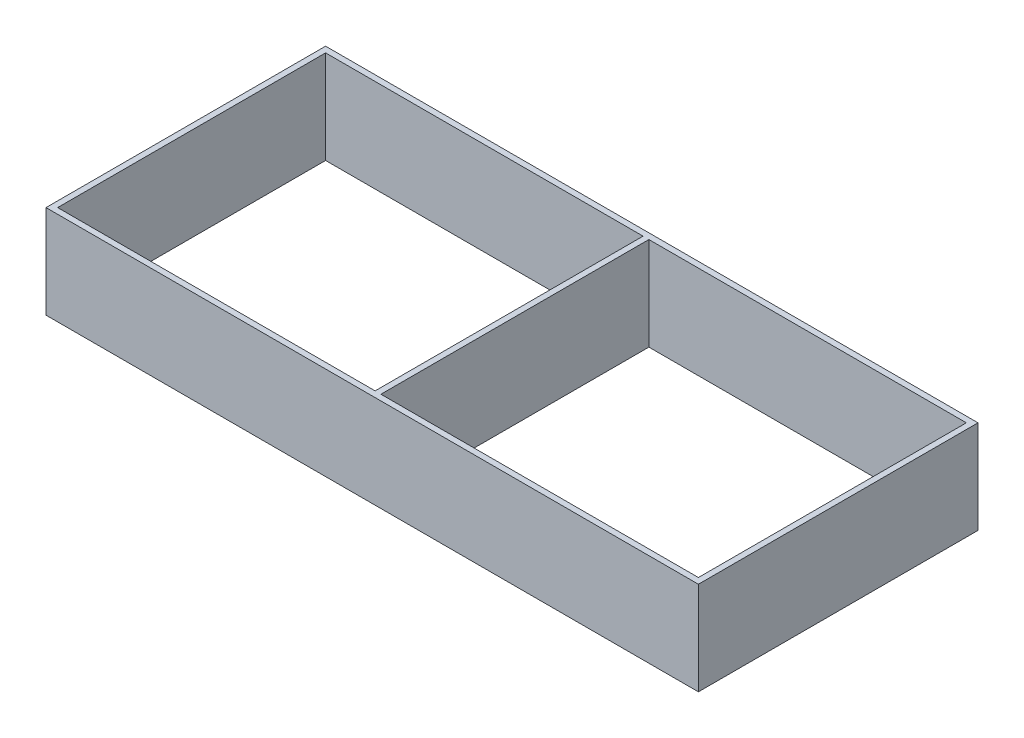
ISO-10303-21;
HEADER;
FILE_DESCRIPTION(('STEP AP214'),'2;1');
FILE_NAME('part.step','',(''),(''),'','','');
FILE_SCHEMA(('AUTOMOTIVE_DESIGN { 1 0 10303 214 1 1 1 1 }'));
ENDSEC;
DATA;
#1=APPLICATION_CONTEXT('core data for automotive mechanical design processes');
#2=APPLICATION_PROTOCOL_DEFINITION('international standard','automotive_design',2000,#1);
#3=PRODUCT_CONTEXT('',#1,'mechanical');
#4=PRODUCT('Part','Part','',(#3));
#5=PRODUCT_RELATED_PRODUCT_CATEGORY('part','',(#4));
#6=PRODUCT_DEFINITION_FORMATION('','',#4);
#7=PRODUCT_DEFINITION_CONTEXT('part definition',#1,'design');
#8=PRODUCT_DEFINITION('design','',#6,#7);
#9=PRODUCT_DEFINITION_SHAPE('','',#8);
#10=(LENGTH_UNIT() NAMED_UNIT(*) SI_UNIT(.MILLI.,.METRE.));
#11=(NAMED_UNIT(*) PLANE_ANGLE_UNIT() SI_UNIT($,.RADIAN.));
#12=(NAMED_UNIT(*) SI_UNIT($,.STERADIAN.) SOLID_ANGLE_UNIT());
#13=UNCERTAINTY_MEASURE_WITH_UNIT(LENGTH_MEASURE(1.E-05),#10,'distance_accuracy_value','');
#14=(GEOMETRIC_REPRESENTATION_CONTEXT(3) GLOBAL_UNCERTAINTY_ASSIGNED_CONTEXT((#13)) GLOBAL_UNIT_ASSIGNED_CONTEXT((#10,
#11,#12)) REPRESENTATION_CONTEXT('',''));
#15=CARTESIAN_POINT('',(0.,0.,0.));
#16=DIRECTION('',(0.,0.,1.));
#17=DIRECTION('',(1.,0.,0.));
#18=AXIS2_PLACEMENT_3D('',#15,#16,#17);
#19=CARTESIAN_POINT('',(0.,50.8,0.));
#20=DIRECTION('',(0.,1.,0.));
#21=DIRECTION('',(0.,0.,1.));
#22=AXIS2_PLACEMENT_3D('',#19,#20,#21);
#23=PLANE('',#22);
#24=DIRECTION('',(0.,0.,-1.));
#25=VECTOR('',#24,1.);
#26=CARTESIAN_POINT('',(0.,50.8,0.));
#27=LINE('',#26,#25);
#28=CARTESIAN_POINT('',(0.,50.8,0.));
#29=VERTEX_POINT('',#28);
#30=CARTESIAN_POINT('',(0.,50.8,-152.4));
#31=VERTEX_POINT('',#30);
#32=EDGE_CURVE('E189',#29,#31,#27,.T.);
#33=ORIENTED_EDGE('',*,*,#32,.T.);
#34=DIRECTION('',(-1.,0.,0.));
#35=VECTOR('',#34,1.);
#36=CARTESIAN_POINT('',(0.,50.8,-152.4));
#37=LINE('',#36,#35);
#38=CARTESIAN_POINT('',(-355.6,50.8,-152.4));
#39=VERTEX_POINT('',#38);
#40=EDGE_CURVE('E192',#31,#39,#37,.T.);
#41=ORIENTED_EDGE('',*,*,#40,.T.);
#42=DIRECTION('',(0.,0.,1.));
#43=VECTOR('',#42,1.);
#44=CARTESIAN_POINT('',(-355.6,50.8,0.));
#45=LINE('',#44,#43);
#46=CARTESIAN_POINT('',(-355.6,50.8,0.));
#47=VERTEX_POINT('',#46);
#48=EDGE_CURVE('E195',#39,#47,#45,.T.);
#49=ORIENTED_EDGE('',*,*,#48,.T.);
#50=DIRECTION('',(1.,0.,0.));
#51=VECTOR('',#50,1.);
#52=CARTESIAN_POINT('',(0.,50.8,0.));
#53=LINE('',#52,#51);
#54=EDGE_CURVE('E197',#47,#29,#53,.T.);
#55=ORIENTED_EDGE('',*,*,#54,.T.);
#56=EDGE_LOOP('',(#33,#41,#49,#55));
#57=FACE_BOUND('',#56,.T.);
#58=DIRECTION('',(1.,0.,0.));
#59=VECTOR('',#58,1.);
#60=CARTESIAN_POINT('',(-352.425,50.8,-3.17499999999996));
#61=LINE('',#60,#59);
#62=CARTESIAN_POINT('',(-352.425,50.8,-3.17499999999996));
#63=VERTEX_POINT('',#62);
#64=CARTESIAN_POINT('',(-179.3875,50.8,-3.17499999999996));
#65=VERTEX_POINT('',#64);
#66=EDGE_CURVE('E160',#63,#65,#61,.T.);
#67=ORIENTED_EDGE('',*,*,#66,.F.);
#68=DIRECTION('',(0.,0.,1.));
#69=VECTOR('',#68,1.);
#70=CARTESIAN_POINT('',(-352.425,50.8,-149.225));
#71=LINE('',#70,#69);
#72=CARTESIAN_POINT('',(-352.425,50.8,-149.225));
#73=VERTEX_POINT('',#72);
#74=EDGE_CURVE('E158',#73,#63,#71,.T.);
#75=ORIENTED_EDGE('',*,*,#74,.F.);
#76=DIRECTION('',(-1.,0.,0.));
#77=VECTOR('',#76,1.);
#78=CARTESIAN_POINT('',(-352.425,50.8,-149.225));
#79=LINE('',#78,#77);
#80=CARTESIAN_POINT('',(-179.3875,50.8,-149.225));
#81=VERTEX_POINT('',#80);
#82=EDGE_CURVE('E166',#81,#73,#79,.T.);
#83=ORIENTED_EDGE('',*,*,#82,.F.);
#84=DIRECTION('',(0.,0.,-1.));
#85=VECTOR('',#84,1.);
#86=CARTESIAN_POINT('',(-179.3875,50.8,-149.225));
#87=LINE('',#86,#85);
#88=EDGE_CURVE('E163',#65,#81,#87,.T.);
#89=ORIENTED_EDGE('',*,*,#88,.F.);
#90=EDGE_LOOP('',(#67,#75,#83,#89));
#91=FACE_BOUND('',#90,.T.);
#92=DIRECTION('',(0.,0.,-1.));
#93=VECTOR('',#92,1.);
#94=CARTESIAN_POINT('',(-3.17499999999998,50.8,-149.225));
#95=LINE('',#94,#93);
#96=CARTESIAN_POINT('',(-3.17499999999998,50.8,-3.17499999999996));
#97=VERTEX_POINT('',#96);
#98=CARTESIAN_POINT('',(-3.17499999999998,50.8,-149.225));
#99=VERTEX_POINT('',#98);
#100=EDGE_CURVE('E130',#97,#99,#95,.T.);
#101=ORIENTED_EDGE('',*,*,#100,.F.);
#102=DIRECTION('',(1.,0.,0.));
#103=VECTOR('',#102,1.);
#104=CARTESIAN_POINT('',(-176.2125,50.8,-3.17499999999996));
#105=LINE('',#104,#103);
#106=CARTESIAN_POINT('',(-176.2125,50.8,-3.17499999999996));
#107=VERTEX_POINT('',#106);
#108=EDGE_CURVE('E122',#107,#97,#105,.T.);
#109=ORIENTED_EDGE('',*,*,#108,.F.);
#110=DIRECTION('',(0.,0.,1.));
#111=VECTOR('',#110,1.);
#112=CARTESIAN_POINT('',(-176.2125,50.8,-149.225));
#113=LINE('',#112,#111);
#114=CARTESIAN_POINT('',(-176.2125,50.8,-149.225));
#115=VERTEX_POINT('',#114);
#116=EDGE_CURVE('E144',#115,#107,#113,.T.);
#117=ORIENTED_EDGE('',*,*,#116,.F.);
#118=DIRECTION('',(-1.,0.,0.));
#119=VECTOR('',#118,1.);
#120=CARTESIAN_POINT('',(-176.2125,50.8,-149.225));
#121=LINE('',#120,#119);
#122=EDGE_CURVE('E142',#99,#115,#121,.T.);
#123=ORIENTED_EDGE('',*,*,#122,.F.);
#124=EDGE_LOOP('',(#101,#109,#117,#123));
#125=FACE_BOUND('',#124,.T.);
#126=ADVANCED_FACE('F33',(#57,#91,#125),#23,.T.);
#127=CARTESIAN_POINT('',(0.,0.,0.));
#128=DIRECTION('',(0.,1.,0.));
#129=DIRECTION('',(0.,0.,1.));
#130=AXIS2_PLACEMENT_3D('',#127,#128,#129);
#131=PLANE('',#130);
#132=DIRECTION('',(0.,0.,1.));
#133=VECTOR('',#132,1.);
#134=CARTESIAN_POINT('',(-352.425,0.,-149.225));
#135=LINE('',#134,#133);
#136=CARTESIAN_POINT('',(-352.425,0.,-149.225));
#137=VERTEX_POINT('',#136);
#138=CARTESIAN_POINT('',(-352.425,0.,-3.17499999999996));
#139=VERTEX_POINT('',#138);
#140=EDGE_CURVE('E138',#137,#139,#135,.T.);
#141=ORIENTED_EDGE('',*,*,#140,.T.);
#142=DIRECTION('',(1.,0.,0.));
#143=VECTOR('',#142,1.);
#144=CARTESIAN_POINT('',(-352.425,0.,-3.17499999999996));
#145=LINE('',#144,#143);
#146=CARTESIAN_POINT('',(-179.3875,0.,-3.17499999999996));
#147=VERTEX_POINT('',#146);
#148=EDGE_CURVE('E171',#139,#147,#145,.T.);
#149=ORIENTED_EDGE('',*,*,#148,.T.);
#150=DIRECTION('',(0.,0.,-1.));
#151=VECTOR('',#150,1.);
#152=CARTESIAN_POINT('',(-179.3875,0.,-149.225));
#153=LINE('',#152,#151);
#154=CARTESIAN_POINT('',(-179.3875,0.,-149.225));
#155=VERTEX_POINT('',#154);
#156=EDGE_CURVE('E174',#147,#155,#153,.T.);
#157=ORIENTED_EDGE('',*,*,#156,.T.);
#158=DIRECTION('',(-1.,0.,0.));
#159=VECTOR('',#158,1.);
#160=CARTESIAN_POINT('',(-352.425,0.,-149.225));
#161=LINE('',#160,#159);
#162=EDGE_CURVE('E161',#155,#137,#161,.T.);
#163=ORIENTED_EDGE('',*,*,#162,.T.);
#164=EDGE_LOOP('',(#141,#149,#157,#163));
#165=FACE_BOUND('',#164,.T.);
#166=DIRECTION('',(0.,0.,-1.));
#167=VECTOR('',#166,1.);
#168=CARTESIAN_POINT('',(0.,0.,0.));
#169=LINE('',#168,#167);
#170=CARTESIAN_POINT('',(0.,0.,0.));
#171=VERTEX_POINT('',#170);
#172=CARTESIAN_POINT('',(0.,0.,-152.4));
#173=VERTEX_POINT('',#172);
#174=EDGE_CURVE('E188',#171,#173,#169,.T.);
#175=ORIENTED_EDGE('',*,*,#174,.F.);
#176=DIRECTION('',(1.,0.,0.));
#177=VECTOR('',#176,1.);
#178=CARTESIAN_POINT('',(0.,0.,0.));
#179=LINE('',#178,#177);
#180=CARTESIAN_POINT('',(-355.6,0.,0.));
#181=VERTEX_POINT('',#180);
#182=EDGE_CURVE('E193',#181,#171,#179,.T.);
#183=ORIENTED_EDGE('',*,*,#182,.F.);
#184=DIRECTION('',(0.,0.,1.));
#185=VECTOR('',#184,1.);
#186=CARTESIAN_POINT('',(-355.6,0.,0.));
#187=LINE('',#186,#185);
#188=CARTESIAN_POINT('',(-355.6,0.,-152.4));
#189=VERTEX_POINT('',#188);
#190=EDGE_CURVE('E204',#189,#181,#187,.T.);
#191=ORIENTED_EDGE('',*,*,#190,.F.);
#192=DIRECTION('',(-1.,0.,0.));
#193=VECTOR('',#192,1.);
#194=CARTESIAN_POINT('',(0.,0.,-152.4));
#195=LINE('',#194,#193);
#196=EDGE_CURVE('E202',#173,#189,#195,.T.);
#197=ORIENTED_EDGE('',*,*,#196,.F.);
#198=EDGE_LOOP('',(#175,#183,#191,#197));
#199=FACE_BOUND('',#198,.T.);
#200=DIRECTION('',(1.,0.,0.));
#201=VECTOR('',#200,1.);
#202=CARTESIAN_POINT('',(-176.2125,0.,-3.17499999999996));
#203=LINE('',#202,#201);
#204=CARTESIAN_POINT('',(-176.2125,0.,-3.17499999999996));
#205=VERTEX_POINT('',#204);
#206=CARTESIAN_POINT('',(-3.17499999999998,0.,-3.17499999999996));
#207=VERTEX_POINT('',#206);
#208=EDGE_CURVE('E56',#205,#207,#203,.T.);
#209=ORIENTED_EDGE('',*,*,#208,.T.);
#210=DIRECTION('',(0.,0.,-1.));
#211=VECTOR('',#210,1.);
#212=CARTESIAN_POINT('',(-3.17499999999998,0.,-149.225));
#213=LINE('',#212,#211);
#214=CARTESIAN_POINT('',(-3.17499999999998,0.,-149.225));
#215=VERTEX_POINT('',#214);
#216=EDGE_CURVE('E137',#207,#215,#213,.T.);
#217=ORIENTED_EDGE('',*,*,#216,.T.);
#218=DIRECTION('',(-1.,0.,0.));
#219=VECTOR('',#218,1.);
#220=CARTESIAN_POINT('',(-176.2125,0.,-149.225));
#221=LINE('',#220,#219);
#222=CARTESIAN_POINT('',(-176.2125,0.,-149.225));
#223=VERTEX_POINT('',#222);
#224=EDGE_CURVE('E150',#215,#223,#221,.T.);
#225=ORIENTED_EDGE('',*,*,#224,.T.);
#226=DIRECTION('',(0.,0.,1.));
#227=VECTOR('',#226,1.);
#228=CARTESIAN_POINT('',(-176.2125,0.,-149.225));
#229=LINE('',#228,#227);
#230=EDGE_CURVE('E131',#223,#205,#229,.T.);
#231=ORIENTED_EDGE('',*,*,#230,.T.);
#232=EDGE_LOOP('',(#209,#217,#225,#231));
#233=FACE_BOUND('',#232,.T.);
#234=ADVANCED_FACE('F222',(#165,#199,#233),#131,.F.);
#235=CARTESIAN_POINT('',(0.,50.8,0.));
#236=DIRECTION('',(-1.,0.,0.));
#237=DIRECTION('',(0.,0.,1.));
#238=AXIS2_PLACEMENT_3D('',#235,#236,#237);
#239=PLANE('',#238);
#240=ORIENTED_EDGE('',*,*,#174,.T.);
#241=DIRECTION('',(0.,-1.,0.));
#242=VECTOR('',#241,1.);
#243=CARTESIAN_POINT('',(0.,50.8,-152.4));
#244=LINE('',#243,#242);
#245=EDGE_CURVE('E11',#31,#173,#244,.T.);
#246=ORIENTED_EDGE('',*,*,#245,.F.);
#247=ORIENTED_EDGE('',*,*,#32,.F.);
#248=DIRECTION('',(0.,-1.,0.));
#249=VECTOR('',#248,1.);
#250=CARTESIAN_POINT('',(0.,50.8,0.));
#251=LINE('',#250,#249);
#252=EDGE_CURVE('E199',#29,#171,#251,.T.);
#253=ORIENTED_EDGE('',*,*,#252,.T.);
#254=EDGE_LOOP('',(#240,#246,#247,#253));
#255=FACE_BOUND('',#254,.T.);
#256=ADVANCED_FACE('F35',(#255),#239,.F.);
#257=CARTESIAN_POINT('',(0.,50.8,-152.4));
#258=DIRECTION('',(0.,0.,1.));
#259=DIRECTION('',(1.,0.,0.));
#260=AXIS2_PLACEMENT_3D('',#257,#258,#259);
#261=PLANE('',#260);
#262=ORIENTED_EDGE('',*,*,#196,.T.);
#263=DIRECTION('',(0.,-1.,0.));
#264=VECTOR('',#263,1.);
#265=CARTESIAN_POINT('',(-355.6,50.8,-152.4));
#266=LINE('',#265,#264);
#267=EDGE_CURVE('E41',#39,#189,#266,.T.);
#268=ORIENTED_EDGE('',*,*,#267,.F.);
#269=ORIENTED_EDGE('',*,*,#40,.F.);
#270=ORIENTED_EDGE('',*,*,#245,.T.);
#271=EDGE_LOOP('',(#262,#268,#269,#270));
#272=FACE_BOUND('',#271,.T.);
#273=ADVANCED_FACE('F233',(#272),#261,.F.);
#274=CARTESIAN_POINT('',(-355.6,50.8,0.));
#275=DIRECTION('',(1.,0.,0.));
#276=DIRECTION('',(0.,0.,-1.));
#277=AXIS2_PLACEMENT_3D('',#274,#275,#276);
#278=PLANE('',#277);
#279=ORIENTED_EDGE('',*,*,#190,.T.);
#280=DIRECTION('',(0.,-1.,0.));
#281=VECTOR('',#280,1.);
#282=CARTESIAN_POINT('',(-355.6,50.8,0.));
#283=LINE('',#282,#281);
#284=EDGE_CURVE('E209',#47,#181,#283,.T.);
#285=ORIENTED_EDGE('',*,*,#284,.F.);
#286=ORIENTED_EDGE('',*,*,#48,.F.);
#287=ORIENTED_EDGE('',*,*,#267,.T.);
#288=EDGE_LOOP('',(#279,#285,#286,#287));
#289=FACE_BOUND('',#288,.T.);
#290=ADVANCED_FACE('F216',(#289),#278,.F.);
#291=CARTESIAN_POINT('',(0.,50.8,0.));
#292=DIRECTION('',(0.,0.,-1.));
#293=DIRECTION('',(-1.,0.,0.));
#294=AXIS2_PLACEMENT_3D('',#291,#292,#293);
#295=PLANE('',#294);
#296=ORIENTED_EDGE('',*,*,#182,.T.);
#297=ORIENTED_EDGE('',*,*,#252,.F.);
#298=ORIENTED_EDGE('',*,*,#54,.F.);
#299=ORIENTED_EDGE('',*,*,#284,.T.);
#300=EDGE_LOOP('',(#296,#297,#298,#299));
#301=FACE_BOUND('',#300,.T.);
#302=ADVANCED_FACE('F226',(#301),#295,.F.);
#303=CARTESIAN_POINT('',(-352.425,50.8,-149.225));
#304=DIRECTION('',(1.,0.,0.));
#305=DIRECTION('',(0.,0.,-1.));
#306=AXIS2_PLACEMENT_3D('',#303,#304,#305);
#307=PLANE('',#306);
#308=ORIENTED_EDGE('',*,*,#140,.F.);
#309=DIRECTION('',(0.,-1.,0.));
#310=VECTOR('',#309,1.);
#311=CARTESIAN_POINT('',(-352.425,50.8,-149.225));
#312=LINE('',#311,#310);
#313=EDGE_CURVE('E168',#73,#137,#312,.T.);
#314=ORIENTED_EDGE('',*,*,#313,.F.);
#315=ORIENTED_EDGE('',*,*,#74,.T.);
#316=DIRECTION('',(0.,-1.,0.));
#317=VECTOR('',#316,1.);
#318=CARTESIAN_POINT('',(-352.425,50.8,-3.17499999999996));
#319=LINE('',#318,#317);
#320=EDGE_CURVE('E185',#63,#139,#319,.T.);
#321=ORIENTED_EDGE('',*,*,#320,.T.);
#322=EDGE_LOOP('',(#308,#314,#315,#321));
#323=FACE_BOUND('',#322,.T.);
#324=ADVANCED_FACE('F248',(#323),#307,.T.);
#325=CARTESIAN_POINT('',(-352.425,50.8,-3.17499999999996));
#326=DIRECTION('',(0.,0.,-1.));
#327=DIRECTION('',(-1.,0.,0.));
#328=AXIS2_PLACEMENT_3D('',#325,#326,#327);
#329=PLANE('',#328);
#330=ORIENTED_EDGE('',*,*,#148,.F.);
#331=ORIENTED_EDGE('',*,*,#320,.F.);
#332=ORIENTED_EDGE('',*,*,#66,.T.);
#333=DIRECTION('',(0.,-1.,0.));
#334=VECTOR('',#333,1.);
#335=CARTESIAN_POINT('',(-179.3875,50.8,-3.17499999999996));
#336=LINE('',#335,#334);
#337=EDGE_CURVE('E183',#65,#147,#336,.T.);
#338=ORIENTED_EDGE('',*,*,#337,.T.);
#339=EDGE_LOOP('',(#330,#331,#332,#338));
#340=FACE_BOUND('',#339,.T.);
#341=ADVANCED_FACE('F255',(#340),#329,.T.);
#342=CARTESIAN_POINT('',(-179.3875,50.8,-149.225));
#343=DIRECTION('',(-1.,0.,0.));
#344=DIRECTION('',(0.,0.,1.));
#345=AXIS2_PLACEMENT_3D('',#342,#343,#344);
#346=PLANE('',#345);
#347=ORIENTED_EDGE('',*,*,#156,.F.);
#348=ORIENTED_EDGE('',*,*,#337,.F.);
#349=ORIENTED_EDGE('',*,*,#88,.T.);
#350=DIRECTION('',(0.,-1.,0.));
#351=VECTOR('',#350,1.);
#352=CARTESIAN_POINT('',(-179.3875,50.8,-149.225));
#353=LINE('',#352,#351);
#354=EDGE_CURVE('E181',#81,#155,#353,.T.);
#355=ORIENTED_EDGE('',*,*,#354,.T.);
#356=EDGE_LOOP('',(#347,#348,#349,#355));
#357=FACE_BOUND('',#356,.T.);
#358=ADVANCED_FACE('F260',(#357),#346,.T.);
#359=CARTESIAN_POINT('',(-352.425,50.8,-149.225));
#360=DIRECTION('',(0.,0.,1.));
#361=DIRECTION('',(1.,0.,0.));
#362=AXIS2_PLACEMENT_3D('',#359,#360,#361);
#363=PLANE('',#362);
#364=ORIENTED_EDGE('',*,*,#162,.F.);
#365=ORIENTED_EDGE('',*,*,#354,.F.);
#366=ORIENTED_EDGE('',*,*,#82,.T.);
#367=ORIENTED_EDGE('',*,*,#313,.T.);
#368=EDGE_LOOP('',(#364,#365,#366,#367));
#369=FACE_BOUND('',#368,.T.);
#370=ADVANCED_FACE('F267',(#369),#363,.T.);
#371=CARTESIAN_POINT('',(-176.2125,50.8,-3.17499999999996));
#372=DIRECTION('',(0.,0.,-1.));
#373=DIRECTION('',(-1.,0.,0.));
#374=AXIS2_PLACEMENT_3D('',#371,#372,#373);
#375=PLANE('',#374);
#376=ORIENTED_EDGE('',*,*,#208,.F.);
#377=DIRECTION('',(0.,-1.,0.));
#378=VECTOR('',#377,1.);
#379=CARTESIAN_POINT('',(-176.2125,50.8,-3.17499999999996));
#380=LINE('',#379,#378);
#381=EDGE_CURVE('E126',#107,#205,#380,.T.);
#382=ORIENTED_EDGE('',*,*,#381,.F.);
#383=ORIENTED_EDGE('',*,*,#108,.T.);
#384=DIRECTION('',(0.,-1.,0.));
#385=VECTOR('',#384,1.);
#386=CARTESIAN_POINT('',(-3.17499999999998,50.8,-3.17499999999996));
#387=LINE('',#386,#385);
#388=EDGE_CURVE('E125',#97,#207,#387,.T.);
#389=ORIENTED_EDGE('',*,*,#388,.T.);
#390=EDGE_LOOP('',(#376,#382,#383,#389));
#391=FACE_BOUND('',#390,.T.);
#392=ADVANCED_FACE('F124',(#391),#375,.T.);
#393=CARTESIAN_POINT('',(-3.17499999999998,50.8,-149.225));
#394=DIRECTION('',(-1.,0.,0.));
#395=DIRECTION('',(0.,0.,1.));
#396=AXIS2_PLACEMENT_3D('',#393,#394,#395);
#397=PLANE('',#396);
#398=ORIENTED_EDGE('',*,*,#216,.F.);
#399=ORIENTED_EDGE('',*,*,#388,.F.);
#400=ORIENTED_EDGE('',*,*,#100,.T.);
#401=DIRECTION('',(0.,-1.,0.));
#402=VECTOR('',#401,1.);
#403=CARTESIAN_POINT('',(-3.17499999999998,50.8,-149.225));
#404=LINE('',#403,#402);
#405=EDGE_CURVE('E139',#99,#215,#404,.T.);
#406=ORIENTED_EDGE('',*,*,#405,.T.);
#407=EDGE_LOOP('',(#398,#399,#400,#406));
#408=FACE_BOUND('',#407,.T.);
#409=ADVANCED_FACE('F134',(#408),#397,.T.);
#410=CARTESIAN_POINT('',(-176.2125,50.8,-149.225));
#411=DIRECTION('',(0.,0.,1.));
#412=DIRECTION('',(1.,0.,0.));
#413=AXIS2_PLACEMENT_3D('',#410,#411,#412);
#414=PLANE('',#413);
#415=ORIENTED_EDGE('',*,*,#224,.F.);
#416=ORIENTED_EDGE('',*,*,#405,.F.);
#417=ORIENTED_EDGE('',*,*,#122,.T.);
#418=DIRECTION('',(0.,-1.,0.));
#419=VECTOR('',#418,1.);
#420=CARTESIAN_POINT('',(-176.2125,50.8,-149.225));
#421=LINE('',#420,#419);
#422=EDGE_CURVE('E48',#115,#223,#421,.T.);
#423=ORIENTED_EDGE('',*,*,#422,.T.);
#424=EDGE_LOOP('',(#415,#416,#417,#423));
#425=FACE_BOUND('',#424,.T.);
#426=ADVANCED_FACE('F285',(#425),#414,.T.);
#427=CARTESIAN_POINT('',(-176.2125,50.8,-149.225));
#428=DIRECTION('',(1.,0.,0.));
#429=DIRECTION('',(0.,0.,-1.));
#430=AXIS2_PLACEMENT_3D('',#427,#428,#429);
#431=PLANE('',#430);
#432=ORIENTED_EDGE('',*,*,#230,.F.);
#433=ORIENTED_EDGE('',*,*,#422,.F.);
#434=ORIENTED_EDGE('',*,*,#116,.T.);
#435=ORIENTED_EDGE('',*,*,#381,.T.);
#436=EDGE_LOOP('',(#432,#433,#434,#435));
#437=FACE_BOUND('',#436,.T.);
#438=ADVANCED_FACE('F288',(#437),#431,.T.);
#439=CLOSED_SHELL('',(#126,#234,#256,#273,#290,#302,#324,#341,#358,#370,#392,#409,#426,#438));
#440=MANIFOLD_SOLID_BREP('B2',#439);
#441=ADVANCED_BREP_SHAPE_REPRESENTATION('',(#18,#440),#14);
#442=SHAPE_DEFINITION_REPRESENTATION(#9,#441);
ENDSEC;
END-ISO-10303-21;
